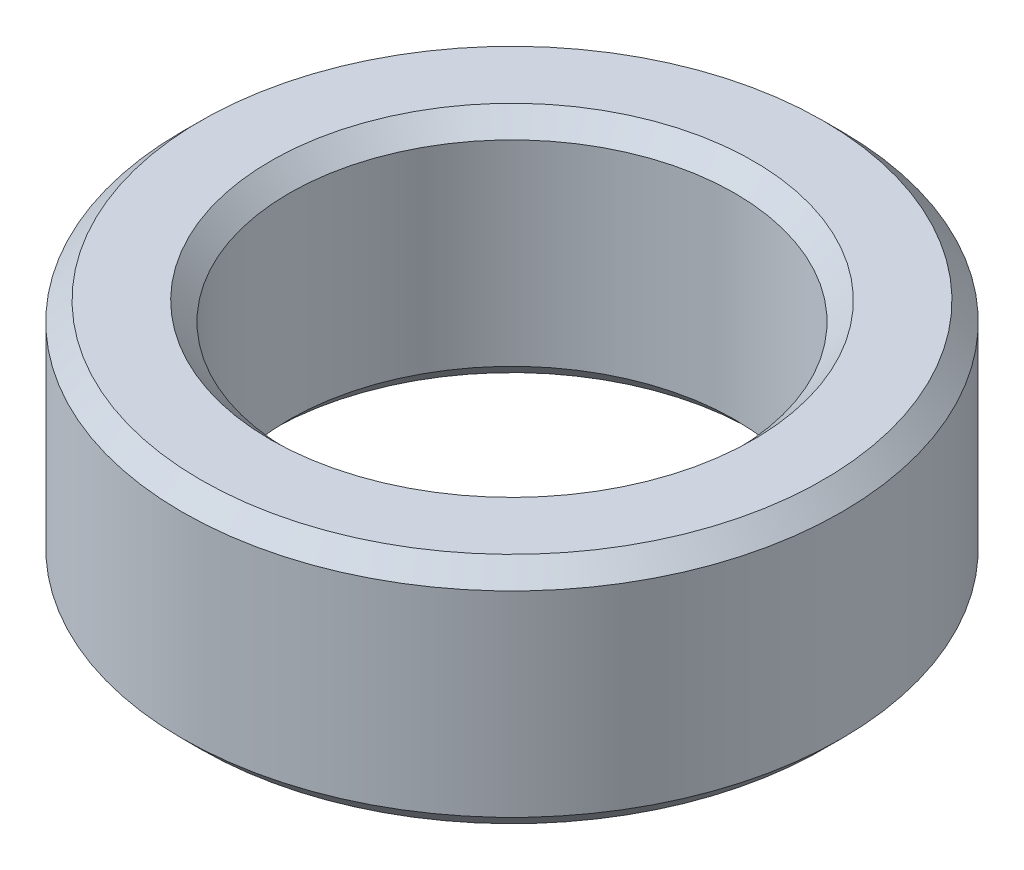
ISO-10303-21;
HEADER;
FILE_DESCRIPTION(('STEP AP214'),'2;1');
FILE_NAME('part.step','',(''),(''),'','','');
FILE_SCHEMA(('AUTOMOTIVE_DESIGN { 1 0 10303 214 1 1 1 1 }'));
ENDSEC;
DATA;
#1=APPLICATION_CONTEXT('core data for automotive mechanical design processes');
#2=APPLICATION_PROTOCOL_DEFINITION('international standard','automotive_design',2000,#1);
#3=PRODUCT_CONTEXT('',#1,'mechanical');
#4=PRODUCT('Part','Part','',(#3));
#5=PRODUCT_RELATED_PRODUCT_CATEGORY('part','',(#4));
#6=PRODUCT_DEFINITION_FORMATION('','',#4);
#7=PRODUCT_DEFINITION_CONTEXT('part definition',#1,'design');
#8=PRODUCT_DEFINITION('design','',#6,#7);
#9=PRODUCT_DEFINITION_SHAPE('','',#8);
#10=(LENGTH_UNIT() NAMED_UNIT(*) SI_UNIT(.MILLI.,.METRE.));
#11=(NAMED_UNIT(*) PLANE_ANGLE_UNIT() SI_UNIT($,.RADIAN.));
#12=(NAMED_UNIT(*) SI_UNIT($,.STERADIAN.) SOLID_ANGLE_UNIT());
#13=UNCERTAINTY_MEASURE_WITH_UNIT(LENGTH_MEASURE(1.E-05),#10,'distance_accuracy_value','');
#14=(GEOMETRIC_REPRESENTATION_CONTEXT(3) GLOBAL_UNCERTAINTY_ASSIGNED_CONTEXT((#13)) GLOBAL_UNIT_ASSIGNED_CONTEXT((#10,
#11,#12)) REPRESENTATION_CONTEXT('',''));
#15=CARTESIAN_POINT('',(0.,0.,0.));
#16=DIRECTION('',(0.,0.,1.));
#17=DIRECTION('',(1.,0.,0.));
#18=AXIS2_PLACEMENT_3D('',#15,#16,#17);
#19=CARTESIAN_POINT('',(0.,8.84341157114789,0.));
#20=DIRECTION('',(0.,-1.,0.));
#21=DIRECTION('',(0.,0.,-1.));
#22=AXIS2_PLACEMENT_3D('',#19,#20,#21);
#23=CYLINDRICAL_SURFACE('',#22,12.5);
#24=CARTESIAN_POINT('',(0.,0.704482384122329,0.));
#25=DIRECTION('',(0.,1.,0.));
#26=DIRECTION('',(0.,0.,1.));
#27=AXIS2_PLACEMENT_3D('',#24,#25,#26);
#28=CIRCLE('',#27,12.5);
#29=CARTESIAN_POINT('',(0.,0.704482384122329,12.5));
#30=VERTEX_POINT('',#29);
#31=EDGE_CURVE('E10',#30,#30,#28,.T.);
#32=ORIENTED_EDGE('',*,*,#31,.T.);
#33=EDGE_LOOP('',(#32));
#34=FACE_BOUND('',#33,.T.);
#35=CARTESIAN_POINT('',(0.,8.13892918702556,0.));
#36=DIRECTION('',(0.,1.,0.));
#37=DIRECTION('',(0.,0.,1.));
#38=AXIS2_PLACEMENT_3D('',#35,#36,#37);
#39=CIRCLE('',#38,12.5);
#40=CARTESIAN_POINT('',(0.,8.13892918702556,-12.5));
#41=VERTEX_POINT('',#40);
#42=EDGE_CURVE('E50',#41,#41,#39,.F.);
#43=ORIENTED_EDGE('',*,*,#42,.T.);
#44=EDGE_LOOP('',(#43));
#45=FACE_BOUND('',#44,.T.);
#46=ADVANCED_FACE('F39',(#34,#45),#23,.T.);
#47=CARTESIAN_POINT('',(0.,8.84341157114789,0.));
#48=DIRECTION('',(0.,1.,0.));
#49=DIRECTION('',(0.,0.,1.));
#50=AXIS2_PLACEMENT_3D('',#47,#48,#49);
#51=PLANE('',#50);
#52=CARTESIAN_POINT('',(0.,8.84341157114789,0.));
#53=DIRECTION('',(0.,1.,0.));
#54=DIRECTION('',(0.,0.,1.));
#55=AXIS2_PLACEMENT_3D('',#52,#53,#54);
#56=CIRCLE('',#55,9.15116242178969);
#57=CARTESIAN_POINT('',(0.,8.84341157114789,9.15116242178969));
#58=VERTEX_POINT('',#57);
#59=EDGE_CURVE('E58',#58,#58,#56,.F.);
#60=ORIENTED_EDGE('',*,*,#59,.T.);
#61=EDGE_LOOP('',(#60));
#62=FACE_BOUND('',#61,.T.);
#63=CARTESIAN_POINT('',(0.,8.84341157114789,0.));
#64=DIRECTION('',(0.,1.,0.));
#65=DIRECTION('',(0.,0.,1.));
#66=AXIS2_PLACEMENT_3D('',#63,#64,#65);
#67=CIRCLE('',#66,11.7955176158777);
#68=CARTESIAN_POINT('',(0.,8.84341157114789,-11.7955176158777));
#69=VERTEX_POINT('',#68);
#70=EDGE_CURVE('E61',#69,#69,#67,.T.);
#71=ORIENTED_EDGE('',*,*,#70,.T.);
#72=EDGE_LOOP('',(#71));
#73=FACE_BOUND('',#72,.T.);
#74=ADVANCED_FACE('F88',(#62,#73),#51,.T.);
#75=CARTESIAN_POINT('',(0.,0.,0.));
#76=DIRECTION('',(0.,1.,0.));
#77=DIRECTION('',(0.,0.,1.));
#78=AXIS2_PLACEMENT_3D('',#75,#76,#77);
#79=PLANE('',#78);
#80=CARTESIAN_POINT('',(0.,0.,0.));
#81=DIRECTION('',(0.,1.,0.));
#82=DIRECTION('',(0.,0.,1.));
#83=AXIS2_PLACEMENT_3D('',#80,#81,#82);
#84=CIRCLE('',#83,9.15116242178968);
#85=CARTESIAN_POINT('',(0.,0.,9.15116242178968));
#86=VERTEX_POINT('',#85);
#87=EDGE_CURVE('E51',#86,#86,#84,.T.);
#88=ORIENTED_EDGE('',*,*,#87,.T.);
#89=EDGE_LOOP('',(#88));
#90=FACE_BOUND('',#89,.T.);
#91=CARTESIAN_POINT('',(0.,0.,0.));
#92=DIRECTION('',(0.,1.,0.));
#93=DIRECTION('',(0.,0.,1.));
#94=AXIS2_PLACEMENT_3D('',#91,#92,#93);
#95=CIRCLE('',#94,11.7955176158777);
#96=CARTESIAN_POINT('',(0.,0.,11.7955176158777));
#97=VERTEX_POINT('',#96);
#98=EDGE_CURVE('E54',#97,#97,#95,.F.);
#99=ORIENTED_EDGE('',*,*,#98,.T.);
#100=EDGE_LOOP('',(#99));
#101=FACE_BOUND('',#100,.T.);
#102=ADVANCED_FACE('F83',(#90,#101),#79,.F.);
#103=CARTESIAN_POINT('',(0.,8.84341157114789,0.));
#104=DIRECTION('',(0.,-1.,0.));
#105=DIRECTION('',(0.,0.,-1.));
#106=AXIS2_PLACEMENT_3D('',#103,#104,#105);
#107=CYLINDRICAL_SURFACE('',#106,8.44668003766736);
#108=CARTESIAN_POINT('',(0.,8.13892918702556,0.));
#109=DIRECTION('',(0.,1.,0.));
#110=DIRECTION('',(0.,0.,1.));
#111=AXIS2_PLACEMENT_3D('',#108,#109,#110);
#112=CIRCLE('',#111,8.44668003766736);
#113=CARTESIAN_POINT('',(0.,8.13892918702556,8.44668003766735));
#114=VERTEX_POINT('',#113);
#115=EDGE_CURVE('E67',#114,#114,#112,.T.);
#116=ORIENTED_EDGE('',*,*,#115,.T.);
#117=EDGE_LOOP('',(#116));
#118=FACE_BOUND('',#117,.T.);
#119=CARTESIAN_POINT('',(0.,0.704482384122332,0.));
#120=DIRECTION('',(0.,1.,0.));
#121=DIRECTION('',(0.,0.,1.));
#122=AXIS2_PLACEMENT_3D('',#119,#120,#121);
#123=CIRCLE('',#122,8.44668003766736);
#124=CARTESIAN_POINT('',(0.,0.704482384122332,8.44668003766736));
#125=VERTEX_POINT('',#124);
#126=EDGE_CURVE('E69',#125,#125,#123,.F.);
#127=ORIENTED_EDGE('',*,*,#126,.T.);
#128=EDGE_LOOP('',(#127));
#129=FACE_BOUND('',#128,.T.);
#130=ADVANCED_FACE('F71',(#118,#129),#107,.F.);
#131=CARTESIAN_POINT('',(0.,8.13892918702556,0.));
#132=DIRECTION('',(0.,1.,0.));
#133=DIRECTION('',(0.,0.,1.));
#134=AXIS2_PLACEMENT_3D('',#131,#132,#133);
#135=CONICAL_SURFACE('',#134,8.44668003766736,0.785398163397447);
#136=CARTESIAN_POINT('',(0.,8.84341157114789,9.15116242178969));
#137=CARTESIAN_POINT('',(0.,8.83607321297995,9.14382406362175));
#138=CARTESIAN_POINT('',(0.,8.82873485481201,9.13648570545381));
#139=CARTESIAN_POINT('',(0.,8.81405813847613,9.12180898911793));
#140=CARTESIAN_POINT('',(0.,8.80671978030819,9.11447063094998));
#141=CARTESIAN_POINT('',(0.,8.79204306397231,9.0997939146141));
#142=CARTESIAN_POINT('',(0.,8.78470470580437,9.09245555644616));
#143=CARTESIAN_POINT('',(0.,8.77002798946848,9.07777884011028));
#144=CARTESIAN_POINT('',(0.,8.76268963130054,9.07044048194234));
#145=CARTESIAN_POINT('',(0.,8.74801291496466,9.05576376560646));
#146=CARTESIAN_POINT('',(0.,8.74067455679672,9.04842540743852));
#147=CARTESIAN_POINT('',(0.,8.72599784046084,9.03374869110263));
#148=CARTESIAN_POINT('',(0.,8.7186594822929,9.02641033293469));
#149=CARTESIAN_POINT('',(0.,8.70398276595702,9.01173361659881));
#150=CARTESIAN_POINT('',(0.,8.69664440778907,9.00439525843087));
#151=CARTESIAN_POINT('',(0.,8.68196769145319,8.98971854209499));
#152=CARTESIAN_POINT('',(0.,8.67462933328525,8.98238018392705));
#153=CARTESIAN_POINT('',(0.,8.65995261694937,8.96770346759116));
#154=CARTESIAN_POINT('',(0.,8.65261425878143,8.96036510942322));
#155=CARTESIAN_POINT('',(0.,8.63793754244555,8.94568839308734));
#156=CARTESIAN_POINT('',(0.,8.6305991842776,8.9383500349194));
#157=CARTESIAN_POINT('',(0.,8.61592246794172,8.92367331858352));
#158=CARTESIAN_POINT('',(0.,8.60858410977378,8.91633496041558));
#159=CARTESIAN_POINT('',(0.,8.5939073934379,8.9016582440797));
#160=CARTESIAN_POINT('',(0.,8.58656903526996,8.89431988591175));
#161=CARTESIAN_POINT('',(0.,8.57189231893408,8.87964316957587));
#162=CARTESIAN_POINT('',(0.,8.56455396076614,8.87230481140793));
#163=CARTESIAN_POINT('',(0.,8.54987724443025,8.85762809507205));
#164=CARTESIAN_POINT('',(0.,8.54253888626231,8.85028973690411));
#165=CARTESIAN_POINT('',(0.,8.52786216992643,8.83561302056823));
#166=CARTESIAN_POINT('',(0.,8.52052381175849,8.82827466240029));
#167=CARTESIAN_POINT('',(0.,8.50584709542261,8.81359794606441));
#168=CARTESIAN_POINT('',(0.,8.49850873725467,8.80625958789646));
#169=CARTESIAN_POINT('',(0.,8.48383202091879,8.79158287156058));
#170=CARTESIAN_POINT('',(0.,8.47649366275084,8.78424451339264));
#171=CARTESIAN_POINT('',(0.,8.46181694641496,8.76956779705676));
#172=CARTESIAN_POINT('',(0.,8.45447858824702,8.76222943888882));
#173=CARTESIAN_POINT('',(0.,8.43980187191114,8.74755272255294));
#174=CARTESIAN_POINT('',(0.,8.4324635137432,8.74021436438499));
#175=CARTESIAN_POINT('',(0.,8.41778679740732,8.72553764804911));
#176=CARTESIAN_POINT('',(0.,8.41044843923937,8.71819928988117));
#177=CARTESIAN_POINT('',(0.,8.39577172290349,8.70352257354529));
#178=CARTESIAN_POINT('',(0.,8.38843336473555,8.69618421537735));
#179=CARTESIAN_POINT('',(0.,8.37375664839967,8.68150749904147));
#180=CARTESIAN_POINT('',(0.,8.36641829023173,8.67416914087353));
#181=CARTESIAN_POINT('',(0.,8.35174157389585,8.65949242453764));
#182=CARTESIAN_POINT('',(0.,8.34440321572791,8.6521540663697));
#183=CARTESIAN_POINT('',(0.,8.32972649939203,8.63747735003382));
#184=CARTESIAN_POINT('',(0.,8.32238814122408,8.63013899186588));
#185=CARTESIAN_POINT('',(0.,8.3077114248882,8.61546227553));
#186=CARTESIAN_POINT('',(0.,8.30037306672026,8.60812391736206));
#187=CARTESIAN_POINT('',(0.,8.28569635038438,8.59344720102617));
#188=CARTESIAN_POINT('',(0.,8.27835799221644,8.58610884285823));
#189=CARTESIAN_POINT('',(0.,8.26368127588056,8.57143212652235));
#190=CARTESIAN_POINT('',(0.,8.25634291771261,8.56409376835441));
#191=CARTESIAN_POINT('',(0.,8.24166620137673,8.54941705201853));
#192=CARTESIAN_POINT('',(0.,8.23432784320879,8.54207869385059));
#193=CARTESIAN_POINT('',(0.,8.21965112687291,8.52740197751471));
#194=CARTESIAN_POINT('',(0.,8.21231276870497,8.52006361934677));
#195=CARTESIAN_POINT('',(0.,8.19763605236909,8.50538690301089));
#196=CARTESIAN_POINT('',(0.,8.19029769420115,8.49804854484294));
#197=CARTESIAN_POINT('',(0.,8.17562097786526,8.48337182850706));
#198=CARTESIAN_POINT('',(0.,8.16828261969732,8.47603347033912));
#199=CARTESIAN_POINT('',(0.,8.15360590336144,8.46135675400324));
#200=CARTESIAN_POINT('',(0.,8.1462675451935,8.4540183958353));
#201=CARTESIAN_POINT('',(0.,8.13892918702556,8.44668003766736));
#202=B_SPLINE_CURVE_WITH_KNOTS('',3,(#136,#137,#138,#139,#140,#141,#142,#143,#144,#145,#146,
#147,#148,#149,#150,#151,#152,#153,#154,#155,#156,#157,#158,#159,#160,#161,#162,#163,#164,#165,
#166,#167,#168,#169,#170,#171,#172,#173,#174,#175,#176,#177,#178,#179,#180,#181,#182,#183,#184,
#185,#186,#187,#188,#189,#190,#191,#192,#193,#194,#195,#196,#197,#198,#199,#200,#201),
.UNSPECIFIED.,.F.,.F.,(4,2,2,2,2,2,2,2,2,2,2,2,2,2,2,2,2,2,2,2,2,2,2,2,2,2,2,2,2,2,2,2,4),(0.,
0.0311340169399601,0.0622680338799214,0.0934020508198827,0.124536067759842,0.155670084699803,
0.186804101639764,0.217938118579724,0.249072135519684,0.280206152459646,0.311340169399606,
0.342474186339566,0.373608203279527,0.404742220219487,0.435876237159448,0.467010254099408,
0.498144271039369,0.52927828797933,0.56041230491929,0.591546321859251,0.622680338799211,
0.653814355739173,0.684948372679133,0.716082389619093,0.747216406559054,0.778350423499016,
0.809484440438974,0.840618457378936,0.871752474318897,0.902886491258856,0.934020508198817,
0.965154525138778,0.996288542078737),.UNSPECIFIED.);
#203=EDGE_CURVE('BSEAM77',#58,#114,#202,.T.);
#204=ORIENTED_EDGE('',*,*,#59,.F.);
#205=ORIENTED_EDGE('',*,*,#115,.F.);
#206=ORIENTED_EDGE('',*,*,#203,.T.);
#207=ORIENTED_EDGE('',*,*,#203,.F.);
#208=EDGE_LOOP('',(#204,#206,#205,#207));
#209=FACE_BOUND('',#208,.T.);
#210=ADVANCED_FACE('F77',(#209),#135,.F.);
#211=CARTESIAN_POINT('',(0.,0.,0.));
#212=DIRECTION('',(0.,-1.,0.));
#213=DIRECTION('',(0.,0.,-1.));
#214=AXIS2_PLACEMENT_3D('',#211,#212,#213);
#215=CONICAL_SURFACE('',#214,9.15116242178968,0.785398163397445);
#216=ORIENTED_EDGE('',*,*,#126,.F.);
#217=EDGE_LOOP('',(#216));
#218=FACE_BOUND('',#217,.T.);
#219=ORIENTED_EDGE('',*,*,#87,.F.);
#220=EDGE_LOOP('',(#219));
#221=FACE_BOUND('',#220,.T.);
#222=ADVANCED_FACE('F73',(#218,#221),#215,.F.);
#223=CARTESIAN_POINT('',(0.,0.704482384122329,0.));
#224=DIRECTION('',(0.,1.,0.));
#225=DIRECTION('',(0.,0.,1.));
#226=AXIS2_PLACEMENT_3D('',#223,#224,#225);
#227=CONICAL_SURFACE('',#226,12.5,0.785398163397452);
#228=ORIENTED_EDGE('',*,*,#98,.F.);
#229=EDGE_LOOP('',(#228));
#230=FACE_BOUND('',#229,.T.);
#231=ORIENTED_EDGE('',*,*,#31,.F.);
#232=EDGE_LOOP('',(#231));
#233=FACE_BOUND('',#232,.T.);
#234=ADVANCED_FACE('F76',(#230,#233),#227,.T.);
#235=CARTESIAN_POINT('',(0.,8.84341157114789,0.));
#236=DIRECTION('',(0.,-1.,0.));
#237=DIRECTION('',(0.,0.,-1.));
#238=AXIS2_PLACEMENT_3D('',#235,#236,#237);
#239=CONICAL_SURFACE('',#238,11.7955176158777,0.785398163397445);
#240=CARTESIAN_POINT('',(0.,8.13892918702556,-12.5));
#241=CARTESIAN_POINT('',(0.,8.1462675451935,-12.4926616418321));
#242=CARTESIAN_POINT('',(0.,8.15360590336144,-12.4853232836641));
#243=CARTESIAN_POINT('',(0.,8.16828261969732,-12.4706465673282));
#244=CARTESIAN_POINT('',(0.,8.17562097786526,-12.4633082091603));
#245=CARTESIAN_POINT('',(0.,8.19029769420115,-12.4486314928244));
#246=CARTESIAN_POINT('',(0.,8.19763605236909,-12.4412931346565));
#247=CARTESIAN_POINT('',(0.,8.21231276870497,-12.4266164183206));
#248=CARTESIAN_POINT('',(0.,8.21965112687291,-12.4192780601527));
#249=CARTESIAN_POINT('',(0.,8.23432784320879,-12.4046013438168));
#250=CARTESIAN_POINT('',(0.,8.24166620137673,-12.3972629856488));
#251=CARTESIAN_POINT('',(0.,8.25634291771261,-12.3825862693129));
#252=CARTESIAN_POINT('',(0.,8.26368127588056,-12.375247911145));
#253=CARTESIAN_POINT('',(0.,8.27835799221644,-12.3605711948091));
#254=CARTESIAN_POINT('',(0.,8.28569635038438,-12.3532328366412));
#255=CARTESIAN_POINT('',(0.,8.30037306672026,-12.3385561203053));
#256=CARTESIAN_POINT('',(0.,8.3077114248882,-12.3312177621374));
#257=CARTESIAN_POINT('',(0.,8.32238814122408,-12.3165410458015));
#258=CARTESIAN_POINT('',(0.,8.32972649939203,-12.3092026876335));
#259=CARTESIAN_POINT('',(0.,8.34440321572791,-12.2945259712977));
#260=CARTESIAN_POINT('',(0.,8.35174157389585,-12.2871876131297));
#261=CARTESIAN_POINT('',(0.,8.36641829023173,-12.2725108967938));
#262=CARTESIAN_POINT('',(0.,8.37375664839967,-12.2651725386259));
#263=CARTESIAN_POINT('',(0.,8.38843336473555,-12.25049582229));
#264=CARTESIAN_POINT('',(0.,8.39577172290349,-12.2431574641221));
#265=CARTESIAN_POINT('',(0.,8.41044843923937,-12.2284807477862));
#266=CARTESIAN_POINT('',(0.,8.41778679740732,-12.2211423896182));
#267=CARTESIAN_POINT('',(0.,8.4324635137432,-12.2064656732824));
#268=CARTESIAN_POINT('',(0.,8.43980187191114,-12.1991273151144));
#269=CARTESIAN_POINT('',(0.,8.45447858824702,-12.1844505987785));
#270=CARTESIAN_POINT('',(0.,8.46181694641496,-12.1771122406106));
#271=CARTESIAN_POINT('',(0.,8.47649366275084,-12.1624355242747));
#272=CARTESIAN_POINT('',(0.,8.48383202091878,-12.1550971661068));
#273=CARTESIAN_POINT('',(0.,8.49850873725467,-12.1404204497709));
#274=CARTESIAN_POINT('',(0.,8.50584709542261,-12.133082091603));
#275=CARTESIAN_POINT('',(0.,8.52052381175849,-12.1184053752671));
#276=CARTESIAN_POINT('',(0.,8.52786216992643,-12.1110670170991));
#277=CARTESIAN_POINT('',(0.,8.54253888626231,-12.0963903007633));
#278=CARTESIAN_POINT('',(0.,8.54987724443025,-12.0890519425953));
#279=CARTESIAN_POINT('',(0.,8.56455396076614,-12.0743752262594));
#280=CARTESIAN_POINT('',(0.,8.57189231893408,-12.0670368680915));
#281=CARTESIAN_POINT('',(0.,8.58656903526996,-12.0523601517556));
#282=CARTESIAN_POINT('',(0.,8.5939073934379,-12.0450217935877));
#283=CARTESIAN_POINT('',(0.,8.60858410977378,-12.0303450772518));
#284=CARTESIAN_POINT('',(0.,8.61592246794172,-12.0230067190838));
#285=CARTESIAN_POINT('',(0.,8.6305991842776,-12.008330002748));
#286=CARTESIAN_POINT('',(0.,8.63793754244555,-12.00099164458));
#287=CARTESIAN_POINT('',(0.,8.65261425878143,-11.9863149282441));
#288=CARTESIAN_POINT('',(0.,8.65995261694937,-11.9789765700762));
#289=CARTESIAN_POINT('',(0.,8.67462933328525,-11.9642998537403));
#290=CARTESIAN_POINT('',(0.,8.68196769145319,-11.9569614955724));
#291=CARTESIAN_POINT('',(0.,8.69664440778907,-11.9422847792365));
#292=CARTESIAN_POINT('',(0.,8.70398276595702,-11.9349464210685));
#293=CARTESIAN_POINT('',(0.,8.7186594822929,-11.9202697047327));
#294=CARTESIAN_POINT('',(0.,8.72599784046084,-11.9129313465647));
#295=CARTESIAN_POINT('',(0.,8.74067455679672,-11.8982546302288));
#296=CARTESIAN_POINT('',(0.,8.74801291496466,-11.8909162720609));
#297=CARTESIAN_POINT('',(0.,8.76268963130054,-11.876239555725));
#298=CARTESIAN_POINT('',(0.,8.77002798946848,-11.8689011975571));
#299=CARTESIAN_POINT('',(0.,8.78470470580437,-11.8542244812212));
#300=CARTESIAN_POINT('',(0.,8.79204306397231,-11.8468861230533));
#301=CARTESIAN_POINT('',(0.,8.80671978030819,-11.8322094067174));
#302=CARTESIAN_POINT('',(0.,8.81405813847613,-11.8248710485494));
#303=CARTESIAN_POINT('',(0.,8.82873485481201,-11.8101943322136));
#304=CARTESIAN_POINT('',(0.,8.83607321297995,-11.8028559740456));
#305=CARTESIAN_POINT('',(0.,8.84341157114789,-11.7955176158777));
#306=B_SPLINE_CURVE_WITH_KNOTS('',3,(#240,#241,#242,#243,#244,#245,#246,#247,#248,#249,#250,
#251,#252,#253,#254,#255,#256,#257,#258,#259,#260,#261,#262,#263,#264,#265,#266,#267,#268,#269,
#270,#271,#272,#273,#274,#275,#276,#277,#278,#279,#280,#281,#282,#283,#284,#285,#286,#287,#288,
#289,#290,#291,#292,#293,#294,#295,#296,#297,#298,#299,#300,#301,#302,#303,#304,#305),
.UNSPECIFIED.,.F.,.F.,(4,2,2,2,2,2,2,2,2,2,2,2,2,2,2,2,2,2,2,2,2,2,2,2,2,2,2,2,2,2,2,2,4),(0.,
0.0311340169399588,0.0622680338799201,0.0934020508198802,0.12453606775984,0.155670084699802,
0.186804101639762,0.217938118579723,0.249072135519682,0.280206152459643,0.311340169399604,
0.342474186339563,0.373608203279525,0.404742220219486,0.435876237159446,0.467010254099406,
0.498144271039367,0.529278287979327,0.560412304919288,0.591546321859248,0.622680338799209,
0.65381435573917,0.684948372679129,0.71608238961909,0.747216406559051,0.778350423499012,
0.809484440438972,0.840618457378932,0.871752474318893,0.902886491258853,0.934020508198814,
0.965154525138775,0.996288542078736),.UNSPECIFIED.);
#307=EDGE_CURVE('BSEAM45',#41,#69,#306,.T.);
#308=ORIENTED_EDGE('',*,*,#42,.F.);
#309=ORIENTED_EDGE('',*,*,#70,.F.);
#310=ORIENTED_EDGE('',*,*,#307,.T.);
#311=ORIENTED_EDGE('',*,*,#307,.F.);
#312=EDGE_LOOP('',(#308,#310,#309,#311));
#313=FACE_BOUND('',#312,.T.);
#314=ADVANCED_FACE('F45',(#313),#239,.T.);
#315=CLOSED_SHELL('',(#46,#74,#102,#130,#210,#222,#234,#314));
#316=MANIFOLD_SOLID_BREP('B2',#315);
#317=ADVANCED_BREP_SHAPE_REPRESENTATION('',(#18,#316),#14);
#318=SHAPE_DEFINITION_REPRESENTATION(#9,#317);
ENDSEC;
END-ISO-10303-21;
